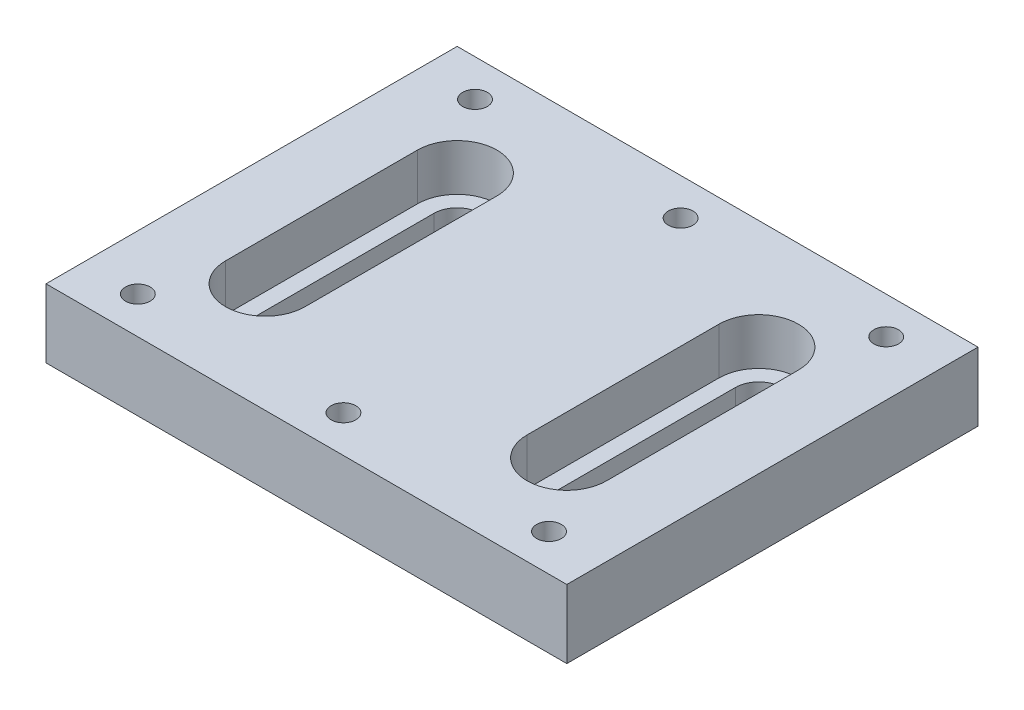
ISO-10303-21;
HEADER;
FILE_DESCRIPTION(('STEP AP214'),'2;1');
FILE_NAME('part.step','',(''),(''),'','','');
FILE_SCHEMA(('AUTOMOTIVE_DESIGN { 1 0 10303 214 1 1 1 1 }'));
ENDSEC;
DATA;
#1=APPLICATION_CONTEXT('core data for automotive mechanical design processes');
#2=APPLICATION_PROTOCOL_DEFINITION('international standard','automotive_design',2000,#1);
#3=PRODUCT_CONTEXT('',#1,'mechanical');
#4=PRODUCT('Part','Part','',(#3));
#5=PRODUCT_RELATED_PRODUCT_CATEGORY('part','',(#4));
#6=PRODUCT_DEFINITION_FORMATION('','',#4);
#7=PRODUCT_DEFINITION_CONTEXT('part definition',#1,'design');
#8=PRODUCT_DEFINITION('design','',#6,#7);
#9=PRODUCT_DEFINITION_SHAPE('','',#8);
#10=(LENGTH_UNIT() NAMED_UNIT(*) SI_UNIT(.MILLI.,.METRE.));
#11=(NAMED_UNIT(*) PLANE_ANGLE_UNIT() SI_UNIT($,.RADIAN.));
#12=(NAMED_UNIT(*) SI_UNIT($,.STERADIAN.) SOLID_ANGLE_UNIT());
#13=UNCERTAINTY_MEASURE_WITH_UNIT(LENGTH_MEASURE(1.E-05),#10,'distance_accuracy_value','');
#14=(GEOMETRIC_REPRESENTATION_CONTEXT(3) GLOBAL_UNCERTAINTY_ASSIGNED_CONTEXT((#13)) GLOBAL_UNIT_ASSIGNED_CONTEXT((#10,
#11,#12)) REPRESENTATION_CONTEXT('',''));
#15=CARTESIAN_POINT('',(0.,0.,0.));
#16=DIRECTION('',(0.,0.,1.));
#17=DIRECTION('',(1.,0.,0.));
#18=AXIS2_PLACEMENT_3D('',#15,#16,#17);
#19=CARTESIAN_POINT('',(0.,-6.35,0.));
#20=DIRECTION('',(0.,1.,0.));
#21=DIRECTION('',(0.,0.,1.));
#22=AXIS2_PLACEMENT_3D('',#19,#20,#21);
#23=PLANE('',#22);
#24=CARTESIAN_POINT('',(0.,-6.35,-15.621));
#25=DIRECTION('',(0.,1.,0.));
#26=DIRECTION('',(0.,0.,1.));
#27=AXIS2_PLACEMENT_3D('',#24,#25,#26);
#28=CIRCLE('',#27,1.143);
#29=CARTESIAN_POINT('',(0.,-6.35,-14.478));
#30=VERTEX_POINT('',#29);
#31=EDGE_CURVE('E302',#30,#30,#28,.T.);
#32=ORIENTED_EDGE('',*,*,#31,.T.);
#33=EDGE_LOOP('',(#32));
#34=FACE_BOUND('',#33,.T.);
#35=CARTESIAN_POINT('',(0.,-6.35,15.621));
#36=DIRECTION('',(0.,1.,0.));
#37=DIRECTION('',(0.,0.,1.));
#38=AXIS2_PLACEMENT_3D('',#35,#36,#37);
#39=CIRCLE('',#38,1.143);
#40=CARTESIAN_POINT('',(0.,-6.35,16.764));
#41=VERTEX_POINT('',#40);
#42=EDGE_CURVE('E308',#41,#41,#39,.T.);
#43=ORIENTED_EDGE('',*,*,#42,.T.);
#44=EDGE_LOOP('',(#43));
#45=FACE_BOUND('',#44,.T.);
#46=CARTESIAN_POINT('',(-19.05,-6.35,15.621));
#47=DIRECTION('',(0.,1.,0.));
#48=DIRECTION('',(0.,0.,1.));
#49=AXIS2_PLACEMENT_3D('',#46,#47,#48);
#50=CIRCLE('',#49,1.143);
#51=CARTESIAN_POINT('',(-19.05,-6.35,16.764));
#52=VERTEX_POINT('',#51);
#53=EDGE_CURVE('E314',#52,#52,#50,.T.);
#54=ORIENTED_EDGE('',*,*,#53,.T.);
#55=EDGE_LOOP('',(#54));
#56=FACE_BOUND('',#55,.T.);
#57=CARTESIAN_POINT('',(-19.05,-6.35,-15.621));
#58=DIRECTION('',(0.,1.,0.));
#59=DIRECTION('',(0.,0.,1.));
#60=AXIS2_PLACEMENT_3D('',#57,#58,#59);
#61=CIRCLE('',#60,1.143);
#62=CARTESIAN_POINT('',(-19.05,-6.35,-14.478));
#63=VERTEX_POINT('',#62);
#64=EDGE_CURVE('E320',#63,#63,#61,.T.);
#65=ORIENTED_EDGE('',*,*,#64,.T.);
#66=EDGE_LOOP('',(#65));
#67=FACE_BOUND('',#66,.T.);
#68=DIRECTION('',(0.,0.,1.));
#69=VECTOR('',#68,1.);
#70=CARTESIAN_POINT('',(-16.129,-6.35,0.));
#71=LINE('',#70,#69);
#72=CARTESIAN_POINT('',(-16.129,-6.35,-8.89));
#73=VERTEX_POINT('',#72);
#74=CARTESIAN_POINT('',(-16.129,-6.35,8.89));
#75=VERTEX_POINT('',#74);
#76=EDGE_CURVE('E261',#73,#75,#71,.T.);
#77=ORIENTED_EDGE('',*,*,#76,.T.);
#78=CARTESIAN_POINT('',(-13.97,-6.35,8.89));
#79=DIRECTION('',(0.,1.,0.));
#80=DIRECTION('',(0.,0.,1.));
#81=AXIS2_PLACEMENT_3D('',#78,#79,#80);
#82=CIRCLE('',#81,2.159);
#83=CARTESIAN_POINT('',(-11.811,-6.35,8.89));
#84=VERTEX_POINT('',#83);
#85=EDGE_CURVE('E266',#75,#84,#82,.T.);
#86=ORIENTED_EDGE('',*,*,#85,.T.);
#87=DIRECTION('',(0.,0.,-1.));
#88=VECTOR('',#87,1.);
#89=CARTESIAN_POINT('',(-11.811,-6.35,0.));
#90=LINE('',#89,#88);
#91=CARTESIAN_POINT('',(-11.811,-6.35,-8.89));
#92=VERTEX_POINT('',#91);
#93=EDGE_CURVE('E253',#84,#92,#90,.T.);
#94=ORIENTED_EDGE('',*,*,#93,.T.);
#95=CARTESIAN_POINT('',(-13.97,-6.35,-8.89));
#96=DIRECTION('',(0.,1.,0.));
#97=DIRECTION('',(0.,0.,1.));
#98=AXIS2_PLACEMENT_3D('',#95,#96,#97);
#99=CIRCLE('',#98,2.159);
#100=EDGE_CURVE('E263',#92,#73,#99,.T.);
#101=ORIENTED_EDGE('',*,*,#100,.T.);
#102=EDGE_LOOP('',(#77,#86,#94,#101));
#103=FACE_BOUND('',#102,.T.);
#104=DIRECTION('',(0.,0.,-1.));
#105=VECTOR('',#104,1.);
#106=CARTESIAN_POINT('',(24.13,-6.35,-19.05));
#107=LINE('',#106,#105);
#108=CARTESIAN_POINT('',(24.13,-6.35,19.05));
#109=VERTEX_POINT('',#108);
#110=CARTESIAN_POINT('',(24.13,-6.35,-19.05));
#111=VERTEX_POINT('',#110);
#112=EDGE_CURVE('E324',#109,#111,#107,.T.);
#113=ORIENTED_EDGE('',*,*,#112,.F.);
#114=DIRECTION('',(1.,0.,0.));
#115=VECTOR('',#114,1.);
#116=CARTESIAN_POINT('',(-24.13,-6.35,19.05));
#117=LINE('',#116,#115);
#118=CARTESIAN_POINT('',(-24.13,-6.35,19.05));
#119=VERTEX_POINT('',#118);
#120=EDGE_CURVE('E334',#119,#109,#117,.T.);
#121=ORIENTED_EDGE('',*,*,#120,.F.);
#122=DIRECTION('',(0.,0.,1.));
#123=VECTOR('',#122,1.);
#124=CARTESIAN_POINT('',(-24.13,-6.35,-19.05));
#125=LINE('',#124,#123);
#126=CARTESIAN_POINT('',(-24.13,-6.35,-19.05));
#127=VERTEX_POINT('',#126);
#128=EDGE_CURVE('E331',#127,#119,#125,.T.);
#129=ORIENTED_EDGE('',*,*,#128,.F.);
#130=DIRECTION('',(-1.,0.,0.));
#131=VECTOR('',#130,1.);
#132=CARTESIAN_POINT('',(-24.13,-6.35,-19.05));
#133=LINE('',#132,#131);
#134=EDGE_CURVE('E327',#111,#127,#133,.T.);
#135=ORIENTED_EDGE('',*,*,#134,.F.);
#136=EDGE_LOOP('',(#113,#121,#129,#135));
#137=FACE_BOUND('',#136,.T.);
#138=CARTESIAN_POINT('',(19.05,-6.35,15.621));
#139=DIRECTION('',(0.,1.,0.));
#140=DIRECTION('',(0.,0.,1.));
#141=AXIS2_PLACEMENT_3D('',#138,#139,#140);
#142=CIRCLE('',#141,1.143);
#143=CARTESIAN_POINT('',(19.05,-6.35,16.764));
#144=VERTEX_POINT('',#143);
#145=EDGE_CURVE('E358',#144,#144,#142,.T.);
#146=ORIENTED_EDGE('',*,*,#145,.T.);
#147=EDGE_LOOP('',(#146));
#148=FACE_BOUND('',#147,.T.);
#149=CARTESIAN_POINT('',(19.05,-6.35,-15.621));
#150=DIRECTION('',(0.,1.,0.));
#151=DIRECTION('',(0.,0.,1.));
#152=AXIS2_PLACEMENT_3D('',#149,#150,#151);
#153=CIRCLE('',#152,1.143);
#154=CARTESIAN_POINT('',(19.05,-6.35,-14.478));
#155=VERTEX_POINT('',#154);
#156=EDGE_CURVE('E11',#155,#155,#153,.T.);
#157=ORIENTED_EDGE('',*,*,#156,.T.);
#158=EDGE_LOOP('',(#157));
#159=FACE_BOUND('',#158,.T.);
#160=CARTESIAN_POINT('',(13.97,-6.35,8.89));
#161=DIRECTION('',(0.,1.,0.));
#162=DIRECTION('',(0.,0.,1.));
#163=AXIS2_PLACEMENT_3D('',#160,#161,#162);
#164=CIRCLE('',#163,2.159);
#165=CARTESIAN_POINT('',(16.129,-6.35,8.89));
#166=VERTEX_POINT('',#165);
#167=CARTESIAN_POINT('',(11.811,-6.35,8.89));
#168=VERTEX_POINT('',#167);
#169=EDGE_CURVE('E208',#166,#168,#164,.F.);
#170=ORIENTED_EDGE('',*,*,#169,.F.);
#171=DIRECTION('',(0.,0.,1.));
#172=VECTOR('',#171,1.);
#173=CARTESIAN_POINT('',(16.129,-6.35,0.));
#174=LINE('',#173,#172);
#175=CARTESIAN_POINT('',(16.129,-6.35,-8.89));
#176=VERTEX_POINT('',#175);
#177=EDGE_CURVE('E201',#176,#166,#174,.T.);
#178=ORIENTED_EDGE('',*,*,#177,.F.);
#179=CARTESIAN_POINT('',(13.97,-6.35,-8.89));
#180=DIRECTION('',(0.,1.,0.));
#181=DIRECTION('',(0.,0.,1.));
#182=AXIS2_PLACEMENT_3D('',#179,#180,#181);
#183=CIRCLE('',#182,2.159);
#184=CARTESIAN_POINT('',(11.811,-6.35,-8.89));
#185=VERTEX_POINT('',#184);
#186=EDGE_CURVE('E180',#185,#176,#183,.F.);
#187=ORIENTED_EDGE('',*,*,#186,.F.);
#188=DIRECTION('',(0.,0.,-1.));
#189=VECTOR('',#188,1.);
#190=CARTESIAN_POINT('',(11.811,-6.35,0.));
#191=LINE('',#190,#189);
#192=EDGE_CURVE('E205',#168,#185,#191,.T.);
#193=ORIENTED_EDGE('',*,*,#192,.F.);
#194=EDGE_LOOP('',(#170,#178,#187,#193));
#195=FACE_BOUND('',#194,.T.);
#196=ADVANCED_FACE('F35',(#34,#45,#56,#67,#103,#137,#148,#159,#195),#23,.F.);
#197=CARTESIAN_POINT('',(13.97,-4.318,0.));
#198=DIRECTION('',(0.,1.,0.));
#199=DIRECTION('',(0.,0.,1.));
#200=AXIS2_PLACEMENT_3D('',#197,#198,#199);
#201=PLANE('',#200);
#202=CARTESIAN_POINT('',(13.97,-4.318,8.89));
#203=DIRECTION('',(0.,1.,0.));
#204=DIRECTION('',(0.,0.,1.));
#205=AXIS2_PLACEMENT_3D('',#202,#203,#204);
#206=CIRCLE('',#205,3.683);
#207=CARTESIAN_POINT('',(10.287,-4.318,8.89));
#208=VERTEX_POINT('',#207);
#209=CARTESIAN_POINT('',(17.653,-4.318,8.89));
#210=VERTEX_POINT('',#209);
#211=EDGE_CURVE('E217',#208,#210,#206,.T.);
#212=ORIENTED_EDGE('',*,*,#211,.T.);
#213=DIRECTION('',(0.,0.,-1.));
#214=VECTOR('',#213,1.);
#215=CARTESIAN_POINT('',(17.653,-4.318,8.89));
#216=LINE('',#215,#214);
#217=CARTESIAN_POINT('',(17.653,-4.318,-8.89));
#218=VERTEX_POINT('',#217);
#219=EDGE_CURVE('E215',#210,#218,#216,.T.);
#220=ORIENTED_EDGE('',*,*,#219,.T.);
#221=CARTESIAN_POINT('',(13.97,-4.318,-8.89));
#222=DIRECTION('',(0.,1.,0.));
#223=DIRECTION('',(0.,0.,1.));
#224=AXIS2_PLACEMENT_3D('',#221,#222,#223);
#225=CIRCLE('',#224,3.683);
#226=CARTESIAN_POINT('',(10.287,-4.318,-8.89));
#227=VERTEX_POINT('',#226);
#228=EDGE_CURVE('E211',#218,#227,#225,.T.);
#229=ORIENTED_EDGE('',*,*,#228,.T.);
#230=DIRECTION('',(0.,0.,1.));
#231=VECTOR('',#230,1.);
#232=CARTESIAN_POINT('',(10.287,-4.318,8.89));
#233=LINE('',#232,#231);
#234=EDGE_CURVE('E214',#227,#208,#233,.T.);
#235=ORIENTED_EDGE('',*,*,#234,.T.);
#236=EDGE_LOOP('',(#212,#220,#229,#235));
#237=FACE_BOUND('',#236,.T.);
#238=DIRECTION('',(0.,0.,1.));
#239=VECTOR('',#238,1.);
#240=CARTESIAN_POINT('',(16.129,-4.318,8.89));
#241=LINE('',#240,#239);
#242=CARTESIAN_POINT('',(16.129,-4.318,-8.89));
#243=VERTEX_POINT('',#242);
#244=CARTESIAN_POINT('',(16.129,-4.318,8.89));
#245=VERTEX_POINT('',#244);
#246=EDGE_CURVE('E50',#243,#245,#241,.T.);
#247=ORIENTED_EDGE('',*,*,#246,.T.);
#248=CARTESIAN_POINT('',(13.97,-4.318,8.89));
#249=DIRECTION('',(0.,-1.,0.));
#250=DIRECTION('',(0.,0.,1.));
#251=AXIS2_PLACEMENT_3D('',#248,#249,#250);
#252=CIRCLE('',#251,2.159);
#253=CARTESIAN_POINT('',(11.811,-4.318,8.89));
#254=VERTEX_POINT('',#253);
#255=EDGE_CURVE('E189',#245,#254,#252,.T.);
#256=ORIENTED_EDGE('',*,*,#255,.T.);
#257=DIRECTION('',(0.,0.,-1.));
#258=VECTOR('',#257,1.);
#259=CARTESIAN_POINT('',(11.811,-4.318,8.89));
#260=LINE('',#259,#258);
#261=CARTESIAN_POINT('',(11.811,-4.318,-8.89));
#262=VERTEX_POINT('',#261);
#263=EDGE_CURVE('E193',#254,#262,#260,.T.);
#264=ORIENTED_EDGE('',*,*,#263,.T.);
#265=CARTESIAN_POINT('',(13.97,-4.318,-8.89));
#266=DIRECTION('',(0.,-1.,0.));
#267=DIRECTION('',(0.,0.,1.));
#268=AXIS2_PLACEMENT_3D('',#265,#266,#267);
#269=CIRCLE('',#268,2.159);
#270=EDGE_CURVE('E178',#262,#243,#269,.T.);
#271=ORIENTED_EDGE('',*,*,#270,.T.);
#272=EDGE_LOOP('',(#247,#256,#264,#271));
#273=FACE_BOUND('',#272,.T.);
#274=ADVANCED_FACE('F191',(#237,#273),#201,.T.);
#275=CARTESIAN_POINT('',(24.13,-6.35,-19.05));
#276=DIRECTION('',(1.,0.,0.));
#277=DIRECTION('',(0.,0.,-1.));
#278=AXIS2_PLACEMENT_3D('',#275,#276,#277);
#279=PLANE('',#278);
#280=DIRECTION('',(0.,0.,-1.));
#281=VECTOR('',#280,1.);
#282=CARTESIAN_POINT('',(24.13,0.,-19.05));
#283=LINE('',#282,#281);
#284=CARTESIAN_POINT('',(24.13,0.,19.05));
#285=VERTEX_POINT('',#284);
#286=CARTESIAN_POINT('',(24.13,0.,-19.05));
#287=VERTEX_POINT('',#286);
#288=EDGE_CURVE('E323',#285,#287,#283,.T.);
#289=ORIENTED_EDGE('',*,*,#288,.F.);
#290=DIRECTION('',(0.,1.,0.));
#291=VECTOR('',#290,1.);
#292=CARTESIAN_POINT('',(24.13,-6.35,19.05));
#293=LINE('',#292,#291);
#294=EDGE_CURVE('E348',#109,#285,#293,.T.);
#295=ORIENTED_EDGE('',*,*,#294,.F.);
#296=ORIENTED_EDGE('',*,*,#112,.T.);
#297=DIRECTION('',(0.,1.,0.));
#298=VECTOR('',#297,1.);
#299=CARTESIAN_POINT('',(24.13,-6.35,-19.05));
#300=LINE('',#299,#298);
#301=EDGE_CURVE('E337',#111,#287,#300,.T.);
#302=ORIENTED_EDGE('',*,*,#301,.T.);
#303=EDGE_LOOP('',(#289,#295,#296,#302));
#304=FACE_BOUND('',#303,.T.);
#305=ADVANCED_FACE('F389',(#304),#279,.T.);
#306=CARTESIAN_POINT('',(-24.13,-6.35,19.05));
#307=DIRECTION('',(0.,0.,1.));
#308=DIRECTION('',(1.,0.,0.));
#309=AXIS2_PLACEMENT_3D('',#306,#307,#308);
#310=PLANE('',#309);
#311=DIRECTION('',(1.,0.,0.));
#312=VECTOR('',#311,1.);
#313=CARTESIAN_POINT('',(-24.13,0.,19.05));
#314=LINE('',#313,#312);
#315=CARTESIAN_POINT('',(-24.13,0.,19.05));
#316=VERTEX_POINT('',#315);
#317=EDGE_CURVE('E328',#316,#285,#314,.T.);
#318=ORIENTED_EDGE('',*,*,#317,.F.);
#319=DIRECTION('',(0.,1.,0.));
#320=VECTOR('',#319,1.);
#321=CARTESIAN_POINT('',(-24.13,-6.35,19.05));
#322=LINE('',#321,#320);
#323=EDGE_CURVE('E351',#119,#316,#322,.T.);
#324=ORIENTED_EDGE('',*,*,#323,.F.);
#325=ORIENTED_EDGE('',*,*,#120,.T.);
#326=ORIENTED_EDGE('',*,*,#294,.T.);
#327=EDGE_LOOP('',(#318,#324,#325,#326));
#328=FACE_BOUND('',#327,.T.);
#329=ADVANCED_FACE('F645',(#328),#310,.T.);
#330=CARTESIAN_POINT('',(-24.13,-6.35,-19.05));
#331=DIRECTION('',(-1.,0.,0.));
#332=DIRECTION('',(0.,0.,1.));
#333=AXIS2_PLACEMENT_3D('',#330,#331,#332);
#334=PLANE('',#333);
#335=DIRECTION('',(0.,0.,1.));
#336=VECTOR('',#335,1.);
#337=CARTESIAN_POINT('',(-24.13,0.,-19.05));
#338=LINE('',#337,#336);
#339=CARTESIAN_POINT('',(-24.13,0.,-19.05));
#340=VERTEX_POINT('',#339);
#341=EDGE_CURVE('E343',#340,#316,#338,.T.);
#342=ORIENTED_EDGE('',*,*,#341,.F.);
#343=DIRECTION('',(0.,1.,0.));
#344=VECTOR('',#343,1.);
#345=CARTESIAN_POINT('',(-24.13,-6.35,-19.05));
#346=LINE('',#345,#344);
#347=EDGE_CURVE('E353',#127,#340,#346,.T.);
#348=ORIENTED_EDGE('',*,*,#347,.F.);
#349=ORIENTED_EDGE('',*,*,#128,.T.);
#350=ORIENTED_EDGE('',*,*,#323,.T.);
#351=EDGE_LOOP('',(#342,#348,#349,#350));
#352=FACE_BOUND('',#351,.T.);
#353=ADVANCED_FACE('F378',(#352),#334,.T.);
#354=CARTESIAN_POINT('',(-24.13,-6.35,-19.05));
#355=DIRECTION('',(0.,0.,-1.));
#356=DIRECTION('',(-1.,0.,0.));
#357=AXIS2_PLACEMENT_3D('',#354,#355,#356);
#358=PLANE('',#357);
#359=DIRECTION('',(-1.,0.,0.));
#360=VECTOR('',#359,1.);
#361=CARTESIAN_POINT('',(-24.13,0.,-19.05));
#362=LINE('',#361,#360);
#363=EDGE_CURVE('E340',#287,#340,#362,.T.);
#364=ORIENTED_EDGE('',*,*,#363,.F.);
#365=ORIENTED_EDGE('',*,*,#301,.F.);
#366=ORIENTED_EDGE('',*,*,#134,.T.);
#367=ORIENTED_EDGE('',*,*,#347,.T.);
#368=EDGE_LOOP('',(#364,#365,#366,#367));
#369=FACE_BOUND('',#368,.T.);
#370=ADVANCED_FACE('F368',(#369),#358,.T.);
#371=CARTESIAN_POINT('',(0.,0.,0.));
#372=DIRECTION('',(0.,1.,0.));
#373=DIRECTION('',(0.,0.,1.));
#374=AXIS2_PLACEMENT_3D('',#371,#372,#373);
#375=PLANE('',#374);
#376=DIRECTION('',(0.,0.,-1.));
#377=VECTOR('',#376,1.);
#378=CARTESIAN_POINT('',(10.287,0.,8.89));
#379=LINE('',#378,#377);
#380=CARTESIAN_POINT('',(10.287,0.,8.89));
#381=VERTEX_POINT('',#380);
#382=CARTESIAN_POINT('',(10.287,0.,-8.89));
#383=VERTEX_POINT('',#382);
#384=EDGE_CURVE('E58',#381,#383,#379,.T.);
#385=ORIENTED_EDGE('',*,*,#384,.T.);
#386=CARTESIAN_POINT('',(13.97,0.,-8.89));
#387=DIRECTION('',(0.,-1.,0.));
#388=DIRECTION('',(0.,0.,1.));
#389=AXIS2_PLACEMENT_3D('',#386,#387,#388);
#390=CIRCLE('',#389,3.683);
#391=CARTESIAN_POINT('',(17.653,0.,-8.89));
#392=VERTEX_POINT('',#391);
#393=EDGE_CURVE('E225',#383,#392,#390,.T.);
#394=ORIENTED_EDGE('',*,*,#393,.T.);
#395=DIRECTION('',(0.,0.,1.));
#396=VECTOR('',#395,1.);
#397=CARTESIAN_POINT('',(17.653,0.,8.89));
#398=LINE('',#397,#396);
#399=CARTESIAN_POINT('',(17.653,0.,8.89));
#400=VERTEX_POINT('',#399);
#401=EDGE_CURVE('E223',#392,#400,#398,.T.);
#402=ORIENTED_EDGE('',*,*,#401,.T.);
#403=CARTESIAN_POINT('',(13.97,0.,8.89));
#404=DIRECTION('',(0.,-1.,0.));
#405=DIRECTION('',(0.,0.,1.));
#406=AXIS2_PLACEMENT_3D('',#403,#404,#405);
#407=CIRCLE('',#406,3.683);
#408=EDGE_CURVE('E210',#400,#381,#407,.T.);
#409=ORIENTED_EDGE('',*,*,#408,.T.);
#410=EDGE_LOOP('',(#385,#394,#402,#409));
#411=FACE_BOUND('',#410,.T.);
#412=CARTESIAN_POINT('',(-13.97,0.,8.89));
#413=DIRECTION('',(0.,1.,0.));
#414=DIRECTION('',(0.,0.,1.));
#415=AXIS2_PLACEMENT_3D('',#412,#413,#414);
#416=CIRCLE('',#415,3.683);
#417=CARTESIAN_POINT('',(-17.653,0.,8.89));
#418=VERTEX_POINT('',#417);
#419=CARTESIAN_POINT('',(-10.287,0.,8.89));
#420=VERTEX_POINT('',#419);
#421=EDGE_CURVE('E269',#418,#420,#416,.T.);
#422=ORIENTED_EDGE('',*,*,#421,.F.);
#423=DIRECTION('',(0.,0.,1.));
#424=VECTOR('',#423,1.);
#425=CARTESIAN_POINT('',(-17.653,0.,8.89));
#426=LINE('',#425,#424);
#427=CARTESIAN_POINT('',(-17.653,0.,-8.89));
#428=VERTEX_POINT('',#427);
#429=EDGE_CURVE('E286',#428,#418,#426,.T.);
#430=ORIENTED_EDGE('',*,*,#429,.F.);
#431=CARTESIAN_POINT('',(-13.97,0.,-8.89));
#432=DIRECTION('',(0.,1.,0.));
#433=DIRECTION('',(0.,0.,1.));
#434=AXIS2_PLACEMENT_3D('',#431,#432,#433);
#435=CIRCLE('',#434,3.683);
#436=CARTESIAN_POINT('',(-10.287,0.,-8.89));
#437=VERTEX_POINT('',#436);
#438=EDGE_CURVE('E283',#437,#428,#435,.T.);
#439=ORIENTED_EDGE('',*,*,#438,.F.);
#440=DIRECTION('',(0.,0.,-1.));
#441=VECTOR('',#440,1.);
#442=CARTESIAN_POINT('',(-10.287,0.,8.89));
#443=LINE('',#442,#441);
#444=EDGE_CURVE('E281',#420,#437,#443,.T.);
#445=ORIENTED_EDGE('',*,*,#444,.F.);
#446=EDGE_LOOP('',(#422,#430,#439,#445));
#447=FACE_BOUND('',#446,.T.);
#448=CARTESIAN_POINT('',(0.,0.,-15.621));
#449=DIRECTION('',(0.,1.,0.));
#450=DIRECTION('',(0.,0.,1.));
#451=AXIS2_PLACEMENT_3D('',#448,#449,#450);
#452=CIRCLE('',#451,1.143);
#453=CARTESIAN_POINT('',(0.,0.,-14.478));
#454=VERTEX_POINT('',#453);
#455=EDGE_CURVE('E299',#454,#454,#452,.T.);
#456=ORIENTED_EDGE('',*,*,#455,.F.);
#457=EDGE_LOOP('',(#456));
#458=FACE_BOUND('',#457,.T.);
#459=CARTESIAN_POINT('',(0.,0.,15.621));
#460=DIRECTION('',(0.,1.,0.));
#461=DIRECTION('',(0.,0.,1.));
#462=AXIS2_PLACEMENT_3D('',#459,#460,#461);
#463=CIRCLE('',#462,1.143);
#464=CARTESIAN_POINT('',(0.,0.,16.764));
#465=VERTEX_POINT('',#464);
#466=EDGE_CURVE('E305',#465,#465,#463,.T.);
#467=ORIENTED_EDGE('',*,*,#466,.F.);
#468=EDGE_LOOP('',(#467));
#469=FACE_BOUND('',#468,.T.);
#470=CARTESIAN_POINT('',(-19.05,0.,15.621));
#471=DIRECTION('',(0.,1.,0.));
#472=DIRECTION('',(0.,0.,1.));
#473=AXIS2_PLACEMENT_3D('',#470,#471,#472);
#474=CIRCLE('',#473,1.143);
#475=CARTESIAN_POINT('',(-19.05,0.,16.764));
#476=VERTEX_POINT('',#475);
#477=EDGE_CURVE('E311',#476,#476,#474,.T.);
#478=ORIENTED_EDGE('',*,*,#477,.F.);
#479=EDGE_LOOP('',(#478));
#480=FACE_BOUND('',#479,.T.);
#481=CARTESIAN_POINT('',(-19.05,0.,-15.621));
#482=DIRECTION('',(0.,1.,0.));
#483=DIRECTION('',(0.,0.,1.));
#484=AXIS2_PLACEMENT_3D('',#481,#482,#483);
#485=CIRCLE('',#484,1.143);
#486=CARTESIAN_POINT('',(-19.05,0.,-14.478));
#487=VERTEX_POINT('',#486);
#488=EDGE_CURVE('E317',#487,#487,#485,.T.);
#489=ORIENTED_EDGE('',*,*,#488,.F.);
#490=EDGE_LOOP('',(#489));
#491=FACE_BOUND('',#490,.T.);
#492=ORIENTED_EDGE('',*,*,#288,.T.);
#493=ORIENTED_EDGE('',*,*,#363,.T.);
#494=ORIENTED_EDGE('',*,*,#341,.T.);
#495=ORIENTED_EDGE('',*,*,#317,.T.);
#496=EDGE_LOOP('',(#492,#493,#494,#495));
#497=FACE_BOUND('',#496,.T.);
#498=CARTESIAN_POINT('',(19.05,0.,15.621));
#499=DIRECTION('',(0.,1.,0.));
#500=DIRECTION('',(0.,0.,1.));
#501=AXIS2_PLACEMENT_3D('',#498,#499,#500);
#502=CIRCLE('',#501,1.143);
#503=CARTESIAN_POINT('',(19.05,0.,16.764));
#504=VERTEX_POINT('',#503);
#505=EDGE_CURVE('E350',#504,#504,#502,.T.);
#506=ORIENTED_EDGE('',*,*,#505,.F.);
#507=EDGE_LOOP('',(#506));
#508=FACE_BOUND('',#507,.T.);
#509=CARTESIAN_POINT('',(19.05,0.,-15.621));
#510=DIRECTION('',(0.,1.,0.));
#511=DIRECTION('',(0.,0.,1.));
#512=AXIS2_PLACEMENT_3D('',#509,#510,#511);
#513=CIRCLE('',#512,1.143);
#514=CARTESIAN_POINT('',(19.05,0.,-14.478));
#515=VERTEX_POINT('',#514);
#516=EDGE_CURVE('E43',#515,#515,#513,.T.);
#517=ORIENTED_EDGE('',*,*,#516,.F.);
#518=EDGE_LOOP('',(#517));
#519=FACE_BOUND('',#518,.T.);
#520=ADVANCED_FACE('F365',(#411,#447,#458,#469,#480,#491,#497,#508,#519),#375,.T.);
#521=CARTESIAN_POINT('',(-13.97,-4.318,0.));
#522=DIRECTION('',(0.,1.,0.));
#523=DIRECTION('',(0.,0.,1.));
#524=AXIS2_PLACEMENT_3D('',#521,#522,#523);
#525=PLANE('',#524);
#526=CARTESIAN_POINT('',(-13.97,-4.318,8.89));
#527=DIRECTION('',(0.,1.,0.));
#528=DIRECTION('',(0.,0.,1.));
#529=AXIS2_PLACEMENT_3D('',#526,#527,#528);
#530=CIRCLE('',#529,2.159);
#531=CARTESIAN_POINT('',(-16.129,-4.318,8.89));
#532=VERTEX_POINT('',#531);
#533=CARTESIAN_POINT('',(-11.811,-4.318,8.89));
#534=VERTEX_POINT('',#533);
#535=EDGE_CURVE('E220',#532,#534,#530,.T.);
#536=ORIENTED_EDGE('',*,*,#535,.F.);
#537=DIRECTION('',(0.,0.,1.));
#538=VECTOR('',#537,1.);
#539=CARTESIAN_POINT('',(-16.129,-4.318,8.89));
#540=LINE('',#539,#538);
#541=CARTESIAN_POINT('',(-16.129,-4.318,-8.89));
#542=VERTEX_POINT('',#541);
#543=EDGE_CURVE('E247',#542,#532,#540,.T.);
#544=ORIENTED_EDGE('',*,*,#543,.F.);
#545=CARTESIAN_POINT('',(-13.97,-4.318,-8.89));
#546=DIRECTION('',(0.,1.,0.));
#547=DIRECTION('',(0.,0.,1.));
#548=AXIS2_PLACEMENT_3D('',#545,#546,#547);
#549=CIRCLE('',#548,2.159);
#550=CARTESIAN_POINT('',(-11.811,-4.318,-8.89));
#551=VERTEX_POINT('',#550);
#552=EDGE_CURVE('E244',#551,#542,#549,.T.);
#553=ORIENTED_EDGE('',*,*,#552,.F.);
#554=DIRECTION('',(0.,0.,-1.));
#555=VECTOR('',#554,1.);
#556=CARTESIAN_POINT('',(-11.811,-4.318,8.89));
#557=LINE('',#556,#555);
#558=EDGE_CURVE('E241',#534,#551,#557,.T.);
#559=ORIENTED_EDGE('',*,*,#558,.F.);
#560=EDGE_LOOP('',(#536,#544,#553,#559));
#561=FACE_BOUND('',#560,.T.);
#562=CARTESIAN_POINT('',(-13.97,-4.318,8.89));
#563=DIRECTION('',(0.,1.,0.));
#564=DIRECTION('',(0.,0.,1.));
#565=AXIS2_PLACEMENT_3D('',#562,#563,#564);
#566=CIRCLE('',#565,3.683);
#567=CARTESIAN_POINT('',(-10.287,-4.318,8.89));
#568=VERTEX_POINT('',#567);
#569=CARTESIAN_POINT('',(-17.653,-4.318,8.89));
#570=VERTEX_POINT('',#569);
#571=EDGE_CURVE('E275',#568,#570,#566,.F.);
#572=ORIENTED_EDGE('',*,*,#571,.F.);
#573=DIRECTION('',(0.,0.,1.));
#574=VECTOR('',#573,1.);
#575=CARTESIAN_POINT('',(-10.287,-4.318,8.89));
#576=LINE('',#575,#574);
#577=CARTESIAN_POINT('',(-10.287,-4.318,-8.89));
#578=VERTEX_POINT('',#577);
#579=EDGE_CURVE('E278',#578,#568,#576,.T.);
#580=ORIENTED_EDGE('',*,*,#579,.F.);
#581=CARTESIAN_POINT('',(-13.97,-4.318,-8.89));
#582=DIRECTION('',(0.,1.,0.));
#583=DIRECTION('',(0.,0.,1.));
#584=AXIS2_PLACEMENT_3D('',#581,#582,#583);
#585=CIRCLE('',#584,3.683);
#586=CARTESIAN_POINT('',(-17.653,-4.318,-8.89));
#587=VERTEX_POINT('',#586);
#588=EDGE_CURVE('E270',#587,#578,#585,.F.);
#589=ORIENTED_EDGE('',*,*,#588,.F.);
#590=DIRECTION('',(0.,0.,-1.));
#591=VECTOR('',#590,1.);
#592=CARTESIAN_POINT('',(-17.653,-4.318,8.89));
#593=LINE('',#592,#591);
#594=EDGE_CURVE('E272',#570,#587,#593,.T.);
#595=ORIENTED_EDGE('',*,*,#594,.F.);
#596=EDGE_LOOP('',(#572,#580,#589,#595));
#597=FACE_BOUND('',#596,.T.);
#598=ADVANCED_FACE('F367',(#561,#597),#525,.T.);
#599=CARTESIAN_POINT('',(-19.05,-9.398,-15.621));
#600=DIRECTION('',(0.,1.,0.));
#601=DIRECTION('',(0.,0.,1.));
#602=AXIS2_PLACEMENT_3D('',#599,#600,#601);
#603=CYLINDRICAL_SURFACE('',#602,1.143);
#604=ORIENTED_EDGE('',*,*,#488,.T.);
#605=EDGE_LOOP('',(#604));
#606=FACE_BOUND('',#605,.T.);
#607=ORIENTED_EDGE('',*,*,#64,.F.);
#608=EDGE_LOOP('',(#607));
#609=FACE_BOUND('',#608,.T.);
#610=ADVANCED_FACE('F375',(#606,#609),#603,.F.);
#611=CARTESIAN_POINT('',(-19.05,-9.398,15.621));
#612=DIRECTION('',(0.,1.,0.));
#613=DIRECTION('',(0.,0.,1.));
#614=AXIS2_PLACEMENT_3D('',#611,#612,#613);
#615=CYLINDRICAL_SURFACE('',#614,1.143);
#616=ORIENTED_EDGE('',*,*,#477,.T.);
#617=EDGE_LOOP('',(#616));
#618=FACE_BOUND('',#617,.T.);
#619=ORIENTED_EDGE('',*,*,#53,.F.);
#620=EDGE_LOOP('',(#619));
#621=FACE_BOUND('',#620,.T.);
#622=ADVANCED_FACE('F396',(#618,#621),#615,.F.);
#623=CARTESIAN_POINT('',(0.,-9.398,15.621));
#624=DIRECTION('',(0.,1.,0.));
#625=DIRECTION('',(0.,0.,1.));
#626=AXIS2_PLACEMENT_3D('',#623,#624,#625);
#627=CYLINDRICAL_SURFACE('',#626,1.143);
#628=ORIENTED_EDGE('',*,*,#466,.T.);
#629=EDGE_LOOP('',(#628));
#630=FACE_BOUND('',#629,.T.);
#631=ORIENTED_EDGE('',*,*,#42,.F.);
#632=EDGE_LOOP('',(#631));
#633=FACE_BOUND('',#632,.T.);
#634=ADVANCED_FACE('F400',(#630,#633),#627,.F.);
#635=CARTESIAN_POINT('',(19.05,-9.398,15.621));
#636=DIRECTION('',(0.,1.,0.));
#637=DIRECTION('',(0.,0.,1.));
#638=AXIS2_PLACEMENT_3D('',#635,#636,#637);
#639=CYLINDRICAL_SURFACE('',#638,1.143);
#640=ORIENTED_EDGE('',*,*,#505,.T.);
#641=EDGE_LOOP('',(#640));
#642=FACE_BOUND('',#641,.T.);
#643=ORIENTED_EDGE('',*,*,#145,.F.);
#644=EDGE_LOOP('',(#643));
#645=FACE_BOUND('',#644,.T.);
#646=ADVANCED_FACE('F404',(#642,#645),#639,.F.);
#647=CARTESIAN_POINT('',(0.,-9.398,-15.621));
#648=DIRECTION('',(0.,1.,0.));
#649=DIRECTION('',(0.,0.,1.));
#650=AXIS2_PLACEMENT_3D('',#647,#648,#649);
#651=CYLINDRICAL_SURFACE('',#650,1.143);
#652=ORIENTED_EDGE('',*,*,#455,.T.);
#653=EDGE_LOOP('',(#652));
#654=FACE_BOUND('',#653,.T.);
#655=ORIENTED_EDGE('',*,*,#31,.F.);
#656=EDGE_LOOP('',(#655));
#657=FACE_BOUND('',#656,.T.);
#658=ADVANCED_FACE('F406',(#654,#657),#651,.F.);
#659=CARTESIAN_POINT('',(19.05,-9.398,-15.621));
#660=DIRECTION('',(0.,1.,0.));
#661=DIRECTION('',(0.,0.,1.));
#662=AXIS2_PLACEMENT_3D('',#659,#660,#661);
#663=CYLINDRICAL_SURFACE('',#662,1.143);
#664=ORIENTED_EDGE('',*,*,#516,.T.);
#665=EDGE_LOOP('',(#664));
#666=FACE_BOUND('',#665,.T.);
#667=ORIENTED_EDGE('',*,*,#156,.F.);
#668=EDGE_LOOP('',(#667));
#669=FACE_BOUND('',#668,.T.);
#670=ADVANCED_FACE('F37',(#666,#669),#663,.F.);
#671=CARTESIAN_POINT('',(-17.653,-30.5206577277955,8.89));
#672=DIRECTION('',(-1.,0.,0.));
#673=DIRECTION('',(0.,0.,1.));
#674=AXIS2_PLACEMENT_3D('',#671,#672,#673);
#675=PLANE('',#674);
#676=ORIENTED_EDGE('',*,*,#429,.T.);
#677=DIRECTION('',(0.,1.,0.));
#678=VECTOR('',#677,1.);
#679=CARTESIAN_POINT('',(-17.653,-30.5206577277955,8.89));
#680=LINE('',#679,#678);
#681=EDGE_CURVE('E273',#570,#418,#680,.T.);
#682=ORIENTED_EDGE('',*,*,#681,.F.);
#683=ORIENTED_EDGE('',*,*,#594,.T.);
#684=DIRECTION('',(0.,1.,0.));
#685=VECTOR('',#684,1.);
#686=CARTESIAN_POINT('',(-17.653,-30.5206577277955,-8.89));
#687=LINE('',#686,#685);
#688=EDGE_CURVE('E291',#587,#428,#687,.T.);
#689=ORIENTED_EDGE('',*,*,#688,.T.);
#690=EDGE_LOOP('',(#676,#682,#683,#689));
#691=FACE_BOUND('',#690,.T.);
#692=ADVANCED_FACE('F418',(#691),#675,.F.);
#693=CARTESIAN_POINT('',(-10.287,-30.5206577277955,8.89));
#694=DIRECTION('',(1.,0.,0.));
#695=DIRECTION('',(0.,0.,-1.));
#696=AXIS2_PLACEMENT_3D('',#693,#694,#695);
#697=PLANE('',#696);
#698=ORIENTED_EDGE('',*,*,#444,.T.);
#699=DIRECTION('',(0.,1.,0.));
#700=VECTOR('',#699,1.);
#701=CARTESIAN_POINT('',(-10.287,-30.5206577277955,-8.89));
#702=LINE('',#701,#700);
#703=EDGE_CURVE('E293',#578,#437,#702,.T.);
#704=ORIENTED_EDGE('',*,*,#703,.F.);
#705=ORIENTED_EDGE('',*,*,#579,.T.);
#706=DIRECTION('',(0.,1.,0.));
#707=VECTOR('',#706,1.);
#708=CARTESIAN_POINT('',(-10.287,-30.5206577277955,8.89));
#709=LINE('',#708,#707);
#710=EDGE_CURVE('E288',#568,#420,#709,.T.);
#711=ORIENTED_EDGE('',*,*,#710,.T.);
#712=EDGE_LOOP('',(#698,#704,#705,#711));
#713=FACE_BOUND('',#712,.T.);
#714=ADVANCED_FACE('F414',(#713),#697,.F.);
#715=CARTESIAN_POINT('',(-13.97,-30.5206577277955,8.89));
#716=DIRECTION('',(0.,1.,0.));
#717=DIRECTION('',(0.,0.,1.));
#718=AXIS2_PLACEMENT_3D('',#715,#716,#717);
#719=CYLINDRICAL_SURFACE('',#718,3.683);
#720=ORIENTED_EDGE('',*,*,#571,.T.);
#721=ORIENTED_EDGE('',*,*,#681,.T.);
#722=ORIENTED_EDGE('',*,*,#421,.T.);
#723=ORIENTED_EDGE('',*,*,#710,.F.);
#724=EDGE_LOOP('',(#720,#721,#722,#723));
#725=FACE_BOUND('',#724,.T.);
#726=ADVANCED_FACE('F410',(#725),#719,.F.);
#727=CARTESIAN_POINT('',(-13.97,-30.5206577277955,-8.89));
#728=DIRECTION('',(0.,1.,0.));
#729=DIRECTION('',(0.,0.,1.));
#730=AXIS2_PLACEMENT_3D('',#727,#728,#729);
#731=CYLINDRICAL_SURFACE('',#730,3.683);
#732=ORIENTED_EDGE('',*,*,#588,.T.);
#733=ORIENTED_EDGE('',*,*,#703,.T.);
#734=ORIENTED_EDGE('',*,*,#438,.T.);
#735=ORIENTED_EDGE('',*,*,#688,.F.);
#736=EDGE_LOOP('',(#732,#733,#734,#735));
#737=FACE_BOUND('',#736,.T.);
#738=ADVANCED_FACE('F413',(#737),#731,.F.);
#739=CARTESIAN_POINT('',(-13.97,-14.478,8.89));
#740=DIRECTION('',(0.,1.,0.));
#741=DIRECTION('',(0.,0.,1.));
#742=AXIS2_PLACEMENT_3D('',#739,#740,#741);
#743=CYLINDRICAL_SURFACE('',#742,2.159);
#744=DIRECTION('',(0.,1.,0.));
#745=VECTOR('',#744,1.);
#746=CARTESIAN_POINT('',(-16.129,-14.478,8.89));
#747=LINE('',#746,#745);
#748=EDGE_CURVE('E250',#75,#532,#747,.T.);
#749=ORIENTED_EDGE('',*,*,#748,.T.);
#750=ORIENTED_EDGE('',*,*,#535,.T.);
#751=DIRECTION('',(0.,1.,0.));
#752=VECTOR('',#751,1.);
#753=CARTESIAN_POINT('',(-11.811,-14.478,8.89));
#754=LINE('',#753,#752);
#755=EDGE_CURVE('E249',#84,#534,#754,.T.);
#756=ORIENTED_EDGE('',*,*,#755,.F.);
#757=ORIENTED_EDGE('',*,*,#85,.F.);
#758=EDGE_LOOP('',(#749,#750,#756,#757));
#759=FACE_BOUND('',#758,.T.);
#760=ADVANCED_FACE('F422',(#759),#743,.F.);
#761=CARTESIAN_POINT('',(-13.97,-14.478,-8.89));
#762=DIRECTION('',(0.,1.,0.));
#763=DIRECTION('',(0.,0.,1.));
#764=AXIS2_PLACEMENT_3D('',#761,#762,#763);
#765=CYLINDRICAL_SURFACE('',#764,2.159);
#766=DIRECTION('',(0.,1.,0.));
#767=VECTOR('',#766,1.);
#768=CARTESIAN_POINT('',(-11.811,-14.478,-8.89));
#769=LINE('',#768,#767);
#770=EDGE_CURVE('E256',#92,#551,#769,.T.);
#771=ORIENTED_EDGE('',*,*,#770,.T.);
#772=ORIENTED_EDGE('',*,*,#552,.T.);
#773=DIRECTION('',(0.,1.,0.));
#774=VECTOR('',#773,1.);
#775=CARTESIAN_POINT('',(-16.129,-14.478,-8.89));
#776=LINE('',#775,#774);
#777=EDGE_CURVE('E254',#73,#542,#776,.T.);
#778=ORIENTED_EDGE('',*,*,#777,.F.);
#779=ORIENTED_EDGE('',*,*,#100,.F.);
#780=EDGE_LOOP('',(#771,#772,#778,#779));
#781=FACE_BOUND('',#780,.T.);
#782=ADVANCED_FACE('F429',(#781),#765,.F.);
#783=CARTESIAN_POINT('',(-16.129,-14.478,8.89));
#784=DIRECTION('',(-1.,0.,0.));
#785=DIRECTION('',(0.,0.,1.));
#786=AXIS2_PLACEMENT_3D('',#783,#784,#785);
#787=PLANE('',#786);
#788=ORIENTED_EDGE('',*,*,#777,.T.);
#789=ORIENTED_EDGE('',*,*,#543,.T.);
#790=ORIENTED_EDGE('',*,*,#748,.F.);
#791=ORIENTED_EDGE('',*,*,#76,.F.);
#792=EDGE_LOOP('',(#788,#789,#790,#791));
#793=FACE_BOUND('',#792,.T.);
#794=ADVANCED_FACE('F435',(#793),#787,.F.);
#795=CARTESIAN_POINT('',(-11.811,-14.478,8.89));
#796=DIRECTION('',(1.,0.,0.));
#797=DIRECTION('',(0.,0.,-1.));
#798=AXIS2_PLACEMENT_3D('',#795,#796,#797);
#799=PLANE('',#798);
#800=ORIENTED_EDGE('',*,*,#755,.T.);
#801=ORIENTED_EDGE('',*,*,#558,.T.);
#802=ORIENTED_EDGE('',*,*,#770,.F.);
#803=ORIENTED_EDGE('',*,*,#93,.F.);
#804=EDGE_LOOP('',(#800,#801,#802,#803));
#805=FACE_BOUND('',#804,.T.);
#806=ADVANCED_FACE('F431',(#805),#799,.F.);
#807=CARTESIAN_POINT('',(17.653,-30.5206577277955,8.89));
#808=DIRECTION('',(-1.,0.,0.));
#809=DIRECTION('',(0.,0.,1.));
#810=AXIS2_PLACEMENT_3D('',#807,#808,#809);
#811=PLANE('',#810);
#812=ORIENTED_EDGE('',*,*,#219,.F.);
#813=DIRECTION('',(0.,1.,0.));
#814=VECTOR('',#813,1.);
#815=CARTESIAN_POINT('',(17.653,-30.5206577277955,8.89));
#816=LINE('',#815,#814);
#817=EDGE_CURVE('E229',#210,#400,#816,.T.);
#818=ORIENTED_EDGE('',*,*,#817,.T.);
#819=ORIENTED_EDGE('',*,*,#401,.F.);
#820=DIRECTION('',(0.,1.,0.));
#821=VECTOR('',#820,1.);
#822=CARTESIAN_POINT('',(17.653,-30.5206577277955,-8.89));
#823=LINE('',#822,#821);
#824=EDGE_CURVE('E234',#218,#392,#823,.T.);
#825=ORIENTED_EDGE('',*,*,#824,.F.);
#826=EDGE_LOOP('',(#812,#818,#819,#825));
#827=FACE_BOUND('',#826,.T.);
#828=ADVANCED_FACE('F434',(#827),#811,.T.);
#829=CARTESIAN_POINT('',(10.287,-30.5206577277955,8.89));
#830=DIRECTION('',(1.,0.,0.));
#831=DIRECTION('',(0.,0.,-1.));
#832=AXIS2_PLACEMENT_3D('',#829,#830,#831);
#833=PLANE('',#832);
#834=ORIENTED_EDGE('',*,*,#234,.F.);
#835=DIRECTION('',(0.,1.,0.));
#836=VECTOR('',#835,1.);
#837=CARTESIAN_POINT('',(10.287,-30.5206577277955,-8.89));
#838=LINE('',#837,#836);
#839=EDGE_CURVE('E232',#227,#383,#838,.T.);
#840=ORIENTED_EDGE('',*,*,#839,.T.);
#841=ORIENTED_EDGE('',*,*,#384,.F.);
#842=DIRECTION('',(0.,1.,0.));
#843=VECTOR('',#842,1.);
#844=CARTESIAN_POINT('',(10.287,-30.5206577277955,8.89));
#845=LINE('',#844,#843);
#846=EDGE_CURVE('E230',#208,#381,#845,.T.);
#847=ORIENTED_EDGE('',*,*,#846,.F.);
#848=EDGE_LOOP('',(#834,#840,#841,#847));
#849=FACE_BOUND('',#848,.T.);
#850=ADVANCED_FACE('F451',(#849),#833,.T.);
#851=CARTESIAN_POINT('',(13.97,-30.5206577277955,-8.89));
#852=DIRECTION('',(0.,1.,0.));
#853=DIRECTION('',(0.,0.,1.));
#854=AXIS2_PLACEMENT_3D('',#851,#852,#853);
#855=CYLINDRICAL_SURFACE('',#854,3.683);
#856=ORIENTED_EDGE('',*,*,#824,.T.);
#857=ORIENTED_EDGE('',*,*,#393,.F.);
#858=ORIENTED_EDGE('',*,*,#839,.F.);
#859=ORIENTED_EDGE('',*,*,#228,.F.);
#860=EDGE_LOOP('',(#856,#857,#858,#859));
#861=FACE_BOUND('',#860,.T.);
#862=ADVANCED_FACE('F447',(#861),#855,.F.);
#863=CARTESIAN_POINT('',(13.97,-30.5206577277955,8.89));
#864=DIRECTION('',(0.,1.,0.));
#865=DIRECTION('',(0.,0.,1.));
#866=AXIS2_PLACEMENT_3D('',#863,#864,#865);
#867=CYLINDRICAL_SURFACE('',#866,3.683);
#868=ORIENTED_EDGE('',*,*,#846,.T.);
#869=ORIENTED_EDGE('',*,*,#408,.F.);
#870=ORIENTED_EDGE('',*,*,#817,.F.);
#871=ORIENTED_EDGE('',*,*,#211,.F.);
#872=EDGE_LOOP('',(#868,#869,#870,#871));
#873=FACE_BOUND('',#872,.T.);
#874=ADVANCED_FACE('F443',(#873),#867,.F.);
#875=CARTESIAN_POINT('',(13.97,-14.478,8.89));
#876=DIRECTION('',(0.,1.,0.));
#877=DIRECTION('',(0.,0.,1.));
#878=AXIS2_PLACEMENT_3D('',#875,#876,#877);
#879=CYLINDRICAL_SURFACE('',#878,2.159);
#880=ORIENTED_EDGE('',*,*,#169,.T.);
#881=DIRECTION('',(0.,1.,0.));
#882=VECTOR('',#881,1.);
#883=CARTESIAN_POINT('',(11.811,-14.478,8.89));
#884=LINE('',#883,#882);
#885=EDGE_CURVE('E199',#168,#254,#884,.T.);
#886=ORIENTED_EDGE('',*,*,#885,.T.);
#887=ORIENTED_EDGE('',*,*,#255,.F.);
#888=DIRECTION('',(0.,1.,0.));
#889=VECTOR('',#888,1.);
#890=CARTESIAN_POINT('',(16.129,-14.478,8.89));
#891=LINE('',#890,#889);
#892=EDGE_CURVE('E184',#166,#245,#891,.T.);
#893=ORIENTED_EDGE('',*,*,#892,.F.);
#894=EDGE_LOOP('',(#880,#886,#887,#893));
#895=FACE_BOUND('',#894,.T.);
#896=ADVANCED_FACE('F446',(#895),#879,.F.);
#897=CARTESIAN_POINT('',(13.97,-14.478,-8.89));
#898=DIRECTION('',(0.,1.,0.));
#899=DIRECTION('',(0.,0.,1.));
#900=AXIS2_PLACEMENT_3D('',#897,#898,#899);
#901=CYLINDRICAL_SURFACE('',#900,2.159);
#902=ORIENTED_EDGE('',*,*,#186,.T.);
#903=DIRECTION('',(0.,1.,0.));
#904=VECTOR('',#903,1.);
#905=CARTESIAN_POINT('',(16.129,-14.478,-8.89));
#906=LINE('',#905,#904);
#907=EDGE_CURVE('E175',#176,#243,#906,.T.);
#908=ORIENTED_EDGE('',*,*,#907,.T.);
#909=ORIENTED_EDGE('',*,*,#270,.F.);
#910=DIRECTION('',(0.,1.,0.));
#911=VECTOR('',#910,1.);
#912=CARTESIAN_POINT('',(11.811,-14.478,-8.89));
#913=LINE('',#912,#911);
#914=EDGE_CURVE('E183',#185,#262,#913,.T.);
#915=ORIENTED_EDGE('',*,*,#914,.F.);
#916=EDGE_LOOP('',(#902,#908,#909,#915));
#917=FACE_BOUND('',#916,.T.);
#918=ADVANCED_FACE('F176',(#917),#901,.F.);
#919=CARTESIAN_POINT('',(11.811,-14.478,8.89));
#920=DIRECTION('',(1.,0.,0.));
#921=DIRECTION('',(0.,0.,-1.));
#922=AXIS2_PLACEMENT_3D('',#919,#920,#921);
#923=PLANE('',#922);
#924=ORIENTED_EDGE('',*,*,#192,.T.);
#925=ORIENTED_EDGE('',*,*,#914,.T.);
#926=ORIENTED_EDGE('',*,*,#263,.F.);
#927=ORIENTED_EDGE('',*,*,#885,.F.);
#928=EDGE_LOOP('',(#924,#925,#926,#927));
#929=FACE_BOUND('',#928,.T.);
#930=ADVANCED_FACE('F463',(#929),#923,.T.);
#931=CARTESIAN_POINT('',(16.129,-14.478,8.89));
#932=DIRECTION('',(-1.,0.,0.));
#933=DIRECTION('',(0.,0.,1.));
#934=AXIS2_PLACEMENT_3D('',#931,#932,#933);
#935=PLANE('',#934);
#936=ORIENTED_EDGE('',*,*,#177,.T.);
#937=ORIENTED_EDGE('',*,*,#892,.T.);
#938=ORIENTED_EDGE('',*,*,#246,.F.);
#939=ORIENTED_EDGE('',*,*,#907,.F.);
#940=EDGE_LOOP('',(#936,#937,#938,#939));
#941=FACE_BOUND('',#940,.T.);
#942=ADVANCED_FACE('F187',(#941),#935,.T.);
#943=CLOSED_SHELL('',(#196,#274,#305,#329,#353,#370,#520,#598,#610,#622,#634,#646,#658,#670,
#692,#714,#726,#738,#760,#782,#794,#806,#828,#850,#862,#874,#896,#918,#930,#942));
#944=MANIFOLD_SOLID_BREP('B2',#943);
#945=ADVANCED_BREP_SHAPE_REPRESENTATION('',(#18,#944),#14);
#946=SHAPE_DEFINITION_REPRESENTATION(#9,#945);
ENDSEC;
END-ISO-10303-21;
